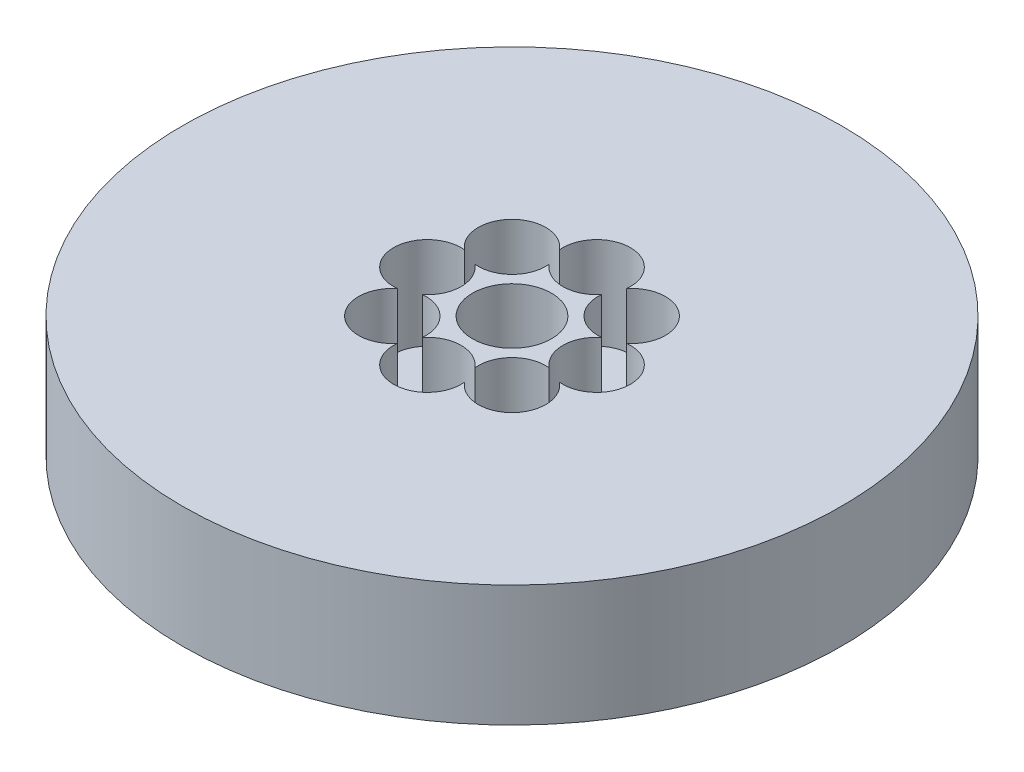
ISO-10303-21;
HEADER;
FILE_DESCRIPTION(('STEP AP214'),'2;1');
FILE_NAME('part.step','',(''),(''),'','','');
FILE_SCHEMA(('AUTOMOTIVE_DESIGN { 1 0 10303 214 1 1 1 1 }'));
ENDSEC;
DATA;
#1=APPLICATION_CONTEXT('core data for automotive mechanical design processes');
#2=APPLICATION_PROTOCOL_DEFINITION('international standard','automotive_design',2000,#1);
#3=PRODUCT_CONTEXT('',#1,'mechanical');
#4=PRODUCT('Part','Part','',(#3));
#5=PRODUCT_RELATED_PRODUCT_CATEGORY('part','',(#4));
#6=PRODUCT_DEFINITION_FORMATION('','',#4);
#7=PRODUCT_DEFINITION_CONTEXT('part definition',#1,'design');
#8=PRODUCT_DEFINITION('design','',#6,#7);
#9=PRODUCT_DEFINITION_SHAPE('','',#8);
#10=(LENGTH_UNIT() NAMED_UNIT(*) SI_UNIT(.MILLI.,.METRE.));
#11=(NAMED_UNIT(*) PLANE_ANGLE_UNIT() SI_UNIT($,.RADIAN.));
#12=(NAMED_UNIT(*) SI_UNIT($,.STERADIAN.) SOLID_ANGLE_UNIT());
#13=UNCERTAINTY_MEASURE_WITH_UNIT(LENGTH_MEASURE(1.E-05),#10,'distance_accuracy_value','');
#14=(GEOMETRIC_REPRESENTATION_CONTEXT(3) GLOBAL_UNCERTAINTY_ASSIGNED_CONTEXT((#13)) GLOBAL_UNIT_ASSIGNED_CONTEXT((#10,
#11,#12)) REPRESENTATION_CONTEXT('',''));
#15=CARTESIAN_POINT('',(0.,0.,0.));
#16=DIRECTION('',(0.,0.,1.));
#17=DIRECTION('',(1.,0.,0.));
#18=AXIS2_PLACEMENT_3D('',#15,#16,#17);
#19=CARTESIAN_POINT('',(0.,23.,0.));
#20=DIRECTION('',(0.,1.,0.));
#21=DIRECTION('',(0.,0.,1.));
#22=AXIS2_PLACEMENT_3D('',#19,#20,#21);
#23=PLANE('',#22);
#24=CARTESIAN_POINT('',(-11.3499906709509,23.,11.349990670951));
#25=DIRECTION('',(0.,1.,0.));
#26=DIRECTION('',(0.707106781186549,0.,0.707106781186546));
#27=AXIS2_PLACEMENT_3D('',#24,#25,#26);
#28=CIRCLE('',#27,6.40229908759105);
#29=CARTESIAN_POINT('',(-4.98422694005276,23.,12.0329882766208));
#30=VERTEX_POINT('',#29);
#31=CARTESIAN_POINT('',(-12.0329882766208,23.,4.9842269400528));
#32=VERTEX_POINT('',#31);
#33=EDGE_CURVE('E248',#30,#32,#28,.T.);
#34=ORIENTED_EDGE('',*,*,#33,.F.);
#35=CARTESIAN_POINT('',(0.,23.,16.0513107396669));
#36=DIRECTION('',(0.,1.,0.));
#37=DIRECTION('',(1.,0.,0.));
#38=AXIS2_PLACEMENT_3D('',#35,#36,#37);
#39=CIRCLE('',#38,6.40229908759105);
#40=CARTESIAN_POINT('',(4.98422694005284,23.,12.0329882766208));
#41=VERTEX_POINT('',#40);
#42=EDGE_CURVE('E230',#41,#30,#39,.T.);
#43=ORIENTED_EDGE('',*,*,#42,.F.);
#44=CARTESIAN_POINT('',(11.349990670951,23.,11.3499906709509));
#45=DIRECTION('',(0.,1.,0.));
#46=DIRECTION('',(0.707106781186544,0.,-0.707106781186551));
#47=AXIS2_PLACEMENT_3D('',#44,#45,#46);
#48=CIRCLE('',#47,6.40229908759105);
#49=CARTESIAN_POINT('',(12.0329882766207,23.,4.9842269400527));
#50=VERTEX_POINT('',#49);
#51=EDGE_CURVE('E204',#50,#41,#48,.T.);
#52=ORIENTED_EDGE('',*,*,#51,.F.);
#53=CARTESIAN_POINT('',(16.0513107396669,23.,0.));
#54=DIRECTION('',(0.,1.,0.));
#55=DIRECTION('',(0.,0.,-1.));
#56=AXIS2_PLACEMENT_3D('',#53,#54,#55);
#57=CIRCLE('',#56,6.40229908759105);
#58=CARTESIAN_POINT('',(12.0329882766209,23.,-4.9842269400529));
#59=VERTEX_POINT('',#58);
#60=EDGE_CURVE('E206',#59,#50,#57,.T.);
#61=ORIENTED_EDGE('',*,*,#60,.F.);
#62=CARTESIAN_POINT('',(11.3499906709508,23.,-11.349990670951));
#63=DIRECTION('',(0.,1.,0.));
#64=DIRECTION('',(-0.707106781186554,0.,-0.707106781186541));
#65=AXIS2_PLACEMENT_3D('',#62,#63,#64);
#66=CIRCLE('',#65,6.40229908759105);
#67=CARTESIAN_POINT('',(4.98422694005267,23.,-12.0329882766208));
#68=VERTEX_POINT('',#67);
#69=EDGE_CURVE('E186',#68,#59,#66,.T.);
#70=ORIENTED_EDGE('',*,*,#69,.F.);
#71=CARTESIAN_POINT('',(-1.68128555734558E-13,23.,-16.0513107396669));
#72=DIRECTION('',(0.,1.,0.));
#73=DIRECTION('',(-1.,0.,0.));
#74=AXIS2_PLACEMENT_3D('',#71,#72,#73);
#75=CIRCLE('',#74,6.40229908759105);
#76=CARTESIAN_POINT('',(-4.98422694005292,23.,-12.0329882766207));
#77=VERTEX_POINT('',#76);
#78=EDGE_CURVE('E163',#77,#68,#75,.T.);
#79=ORIENTED_EDGE('',*,*,#78,.F.);
#80=CARTESIAN_POINT('',(-11.3499906709511,23.,-11.3499906709508));
#81=DIRECTION('',(0.,1.,0.));
#82=DIRECTION('',(-0.707106781186539,0.,0.707106781186556));
#83=AXIS2_PLACEMENT_3D('',#80,#81,#82);
#84=CIRCLE('',#83,6.40229908759105);
#85=CARTESIAN_POINT('',(-12.0329882766205,23.,-4.9842269400526));
#86=VERTEX_POINT('',#85);
#87=EDGE_CURVE('E182',#86,#77,#84,.T.);
#88=ORIENTED_EDGE('',*,*,#87,.F.);
#89=CARTESIAN_POINT('',(-16.0513107396669,23.,0.));
#90=DIRECTION('',(0.,1.,0.));
#91=DIRECTION('',(0.,0.,1.));
#92=AXIS2_PLACEMENT_3D('',#89,#90,#91);
#93=CIRCLE('',#92,6.40229908759105);
#94=EDGE_CURVE('E261',#32,#86,#93,.T.);
#95=ORIENTED_EDGE('',*,*,#94,.F.);
#96=EDGE_LOOP('',(#34,#43,#52,#61,#70,#79,#88,#95));
#97=FACE_BOUND('',#96,.T.);
#98=CARTESIAN_POINT('',(0.,23.,0.));
#99=DIRECTION('',(0.,1.,0.));
#100=DIRECTION('',(0.,0.,1.));
#101=AXIS2_PLACEMENT_3D('',#98,#99,#100);
#102=CIRCLE('',#101,7.5);
#103=CARTESIAN_POINT('',(0.,23.,7.5));
#104=VERTEX_POINT('',#103);
#105=EDGE_CURVE('E262',#104,#104,#102,.T.);
#106=ORIENTED_EDGE('',*,*,#105,.F.);
#107=EDGE_LOOP('',(#106));
#108=FACE_BOUND('',#107,.T.);
#109=ADVANCED_FACE('F39',(#97,#108),#23,.T.);
#110=CARTESIAN_POINT('',(-16.0513107396669,5.48119012254842,0.));
#111=DIRECTION('',(0.,1.,0.));
#112=DIRECTION('',(0.,0.,1.));
#113=AXIS2_PLACEMENT_3D('',#110,#111,#112);
#114=CYLINDRICAL_SURFACE('',#113,6.40229908759105);
#115=CARTESIAN_POINT('',(-16.0513107396669,5.48119012254842,0.));
#116=DIRECTION('',(0.,1.,0.));
#117=DIRECTION('',(0.,0.,1.));
#118=AXIS2_PLACEMENT_3D('',#115,#116,#117);
#119=CIRCLE('',#118,6.40229908759105);
#120=CARTESIAN_POINT('',(-12.0329882766208,5.48119012254842,4.9842269400528));
#121=VERTEX_POINT('',#120);
#122=CARTESIAN_POINT('',(-12.0329882766205,5.48119012254842,-4.9842269400526));
#123=VERTEX_POINT('',#122);
#124=EDGE_CURVE('E257',#121,#123,#119,.T.);
#125=ORIENTED_EDGE('',*,*,#124,.F.);
#126=DIRECTION('',(0.,1.,0.));
#127=VECTOR('',#126,1.);
#128=CARTESIAN_POINT('',(-12.0329882766208,14.2405950612742,4.9842269400528));
#129=LINE('',#128,#127);
#130=EDGE_CURVE('E255',#121,#32,#129,.T.);
#131=ORIENTED_EDGE('',*,*,#130,.T.);
#132=ORIENTED_EDGE('',*,*,#94,.T.);
#133=DIRECTION('',(0.,1.,0.));
#134=VECTOR('',#133,1.);
#135=CARTESIAN_POINT('',(-12.0329882766205,14.2405950612742,-4.9842269400526));
#136=LINE('',#135,#134);
#137=EDGE_CURVE('E250',#86,#123,#136,.F.);
#138=ORIENTED_EDGE('',*,*,#137,.T.);
#139=EDGE_LOOP('',(#125,#131,#132,#138));
#140=FACE_BOUND('',#139,.T.);
#141=ADVANCED_FACE('F277',(#140),#114,.F.);
#142=CARTESIAN_POINT('',(0.,23.,0.));
#143=DIRECTION('',(0.,-1.,0.));
#144=DIRECTION('',(0.,0.,-1.));
#145=AXIS2_PLACEMENT_3D('',#142,#143,#144);
#146=CYLINDRICAL_SURFACE('',#145,62.5);
#147=CARTESIAN_POINT('',(0.,23.,0.));
#148=DIRECTION('',(0.,1.,0.));
#149=DIRECTION('',(0.,0.,1.));
#150=AXIS2_PLACEMENT_3D('',#147,#148,#149);
#151=CIRCLE('',#150,62.5);
#152=CARTESIAN_POINT('',(0.,23.,62.5));
#153=VERTEX_POINT('',#152);
#154=EDGE_CURVE('E11',#153,#153,#151,.T.);
#155=ORIENTED_EDGE('',*,*,#154,.F.);
#156=EDGE_LOOP('',(#155));
#157=FACE_BOUND('',#156,.T.);
#158=CARTESIAN_POINT('',(0.,0.,0.));
#159=DIRECTION('',(0.,1.,0.));
#160=DIRECTION('',(0.,0.,1.));
#161=AXIS2_PLACEMENT_3D('',#158,#159,#160);
#162=CIRCLE('',#161,62.5);
#163=CARTESIAN_POINT('',(0.,0.,62.5));
#164=VERTEX_POINT('',#163);
#165=EDGE_CURVE('E43',#164,#164,#162,.T.);
#166=ORIENTED_EDGE('',*,*,#165,.T.);
#167=EDGE_LOOP('',(#166));
#168=FACE_BOUND('',#167,.T.);
#169=ADVANCED_FACE('F41',(#157,#168),#146,.T.);
#170=CARTESIAN_POINT('',(-15.368313133997,23.,6.36576373089816));
#171=VERTEX_POINT('',#170);
#172=CARTESIAN_POINT('',(-6.3657637308981,23.,15.3683131339971));
#173=VERTEX_POINT('',#172);
#174=EDGE_CURVE('E242',#171,#173,#28,.T.);
#175=ORIENTED_EDGE('',*,*,#174,.F.);
#176=CARTESIAN_POINT('',(-15.3683131339975,23.,-6.3657637308982));
#177=VERTEX_POINT('',#176);
#178=EDGE_CURVE('E260',#177,#171,#93,.T.);
#179=ORIENTED_EDGE('',*,*,#178,.F.);
#180=CARTESIAN_POINT('',(-6.36576373089832,23.,-15.368313133997));
#181=VERTEX_POINT('',#180);
#182=EDGE_CURVE('E178',#181,#177,#84,.T.);
#183=ORIENTED_EDGE('',*,*,#182,.F.);
#184=CARTESIAN_POINT('',(6.36576373089799,23.,-15.3683131339971));
#185=VERTEX_POINT('',#184);
#186=EDGE_CURVE('E168',#185,#181,#75,.T.);
#187=ORIENTED_EDGE('',*,*,#186,.F.);
#188=CARTESIAN_POINT('',(15.3683131339968,23.,-6.36576373089813));
#189=VERTEX_POINT('',#188);
#190=EDGE_CURVE('E195',#189,#185,#66,.T.);
#191=ORIENTED_EDGE('',*,*,#190,.F.);
#192=CARTESIAN_POINT('',(15.3683131339972,23.,6.36576373089818));
#193=VERTEX_POINT('',#192);
#194=EDGE_CURVE('E199',#193,#189,#57,.T.);
#195=ORIENTED_EDGE('',*,*,#194,.F.);
#196=CARTESIAN_POINT('',(6.36576373089821,23.,15.368313133997));
#197=VERTEX_POINT('',#196);
#198=EDGE_CURVE('E213',#197,#193,#48,.T.);
#199=ORIENTED_EDGE('',*,*,#198,.F.);
#200=EDGE_CURVE('E222',#173,#197,#39,.T.);
#201=ORIENTED_EDGE('',*,*,#200,.F.);
#202=EDGE_LOOP('',(#175,#179,#183,#187,#191,#195,#199,#201));
#203=FACE_BOUND('',#202,.T.);
#204=ORIENTED_EDGE('',*,*,#154,.T.);
#205=EDGE_LOOP('',(#204));
#206=FACE_BOUND('',#205,.T.);
#207=ADVANCED_FACE('F319',(#203,#206),#23,.T.);
#208=CARTESIAN_POINT('',(0.,0.,0.));
#209=DIRECTION('',(0.,1.,0.));
#210=DIRECTION('',(0.,0.,1.));
#211=AXIS2_PLACEMENT_3D('',#208,#209,#210);
#212=PLANE('',#211);
#213=CARTESIAN_POINT('',(0.,0.,0.));
#214=DIRECTION('',(0.,1.,0.));
#215=DIRECTION('',(0.,0.,1.));
#216=AXIS2_PLACEMENT_3D('',#213,#214,#215);
#217=CIRCLE('',#216,7.5);
#218=CARTESIAN_POINT('',(0.,0.,7.5));
#219=VERTEX_POINT('',#218);
#220=EDGE_CURVE('E270',#219,#219,#217,.T.);
#221=ORIENTED_EDGE('',*,*,#220,.T.);
#222=EDGE_LOOP('',(#221));
#223=FACE_BOUND('',#222,.T.);
#224=ORIENTED_EDGE('',*,*,#165,.F.);
#225=EDGE_LOOP('',(#224));
#226=FACE_BOUND('',#225,.T.);
#227=ADVANCED_FACE('F327',(#223,#226),#212,.F.);
#228=CARTESIAN_POINT('',(0.,23.,0.));
#229=DIRECTION('',(0.,-1.,0.));
#230=DIRECTION('',(0.,0.,-1.));
#231=AXIS2_PLACEMENT_3D('',#228,#229,#230);
#232=CYLINDRICAL_SURFACE('',#231,7.5);
#233=ORIENTED_EDGE('',*,*,#105,.T.);
#234=EDGE_LOOP('',(#233));
#235=FACE_BOUND('',#234,.T.);
#236=ORIENTED_EDGE('',*,*,#220,.F.);
#237=EDGE_LOOP('',(#236));
#238=FACE_BOUND('',#237,.T.);
#239=ADVANCED_FACE('F331',(#235,#238),#232,.F.);
#240=ORIENTED_EDGE('',*,*,#178,.T.);
#241=DIRECTION('',(0.,1.,0.));
#242=VECTOR('',#241,1.);
#243=CARTESIAN_POINT('',(-15.368313133997,14.2405950612742,6.36576373089816));
#244=LINE('',#243,#242);
#245=CARTESIAN_POINT('',(-15.368313133997,5.48119012254842,6.36576373089816));
#246=VERTEX_POINT('',#245);
#247=EDGE_CURVE('E65',#171,#246,#244,.F.);
#248=ORIENTED_EDGE('',*,*,#247,.T.);
#249=CARTESIAN_POINT('',(-15.3683131339975,5.48119012254842,-6.3657637308982));
#250=VERTEX_POINT('',#249);
#251=EDGE_CURVE('E256',#250,#246,#119,.T.);
#252=ORIENTED_EDGE('',*,*,#251,.F.);
#253=DIRECTION('',(0.,1.,0.));
#254=VECTOR('',#253,1.);
#255=CARTESIAN_POINT('',(-15.3683131339975,14.2405950612742,-6.3657637308982));
#256=LINE('',#255,#254);
#257=EDGE_CURVE('E180',#250,#177,#256,.T.);
#258=ORIENTED_EDGE('',*,*,#257,.T.);
#259=EDGE_LOOP('',(#240,#248,#252,#258));
#260=FACE_BOUND('',#259,.T.);
#261=ADVANCED_FACE('F312',(#260),#114,.F.);
#262=CARTESIAN_POINT('',(-16.0513107396669,5.48119012254842,0.));
#263=DIRECTION('',(0.,1.,0.));
#264=DIRECTION('',(0.,0.,1.));
#265=AXIS2_PLACEMENT_3D('',#262,#263,#264);
#266=PLANE('',#265);
#267=CARTESIAN_POINT('',(-11.3499906709509,5.48119012254842,11.349990670951));
#268=DIRECTION('',(0.,1.,0.));
#269=DIRECTION('',(0.707106781186549,0.,0.707106781186546));
#270=AXIS2_PLACEMENT_3D('',#267,#268,#269);
#271=CIRCLE('',#270,6.40229908759105);
#272=CARTESIAN_POINT('',(-4.98422694005276,5.48119012254842,12.0329882766208));
#273=VERTEX_POINT('',#272);
#274=EDGE_CURVE('E243',#273,#121,#271,.T.);
#275=ORIENTED_EDGE('',*,*,#274,.T.);
#276=ORIENTED_EDGE('',*,*,#124,.T.);
#277=CARTESIAN_POINT('',(-11.3499906709511,5.48119012254842,-11.3499906709508));
#278=DIRECTION('',(0.,1.,0.));
#279=DIRECTION('',(-0.707106781186539,0.,0.707106781186556));
#280=AXIS2_PLACEMENT_3D('',#277,#278,#279);
#281=CIRCLE('',#280,6.40229908759105);
#282=CARTESIAN_POINT('',(-4.98422694005292,5.48119012254842,-12.0329882766207));
#283=VERTEX_POINT('',#282);
#284=EDGE_CURVE('E53',#123,#283,#281,.T.);
#285=ORIENTED_EDGE('',*,*,#284,.T.);
#286=CARTESIAN_POINT('',(-1.68128555734558E-13,5.48119012254842,-16.0513107396669));
#287=DIRECTION('',(0.,1.,0.));
#288=DIRECTION('',(-1.,0.,0.));
#289=AXIS2_PLACEMENT_3D('',#286,#287,#288);
#290=CIRCLE('',#289,6.40229908759105);
#291=CARTESIAN_POINT('',(4.98422694005267,5.48119012254842,-12.0329882766208));
#292=VERTEX_POINT('',#291);
#293=EDGE_CURVE('E162',#283,#292,#290,.T.);
#294=ORIENTED_EDGE('',*,*,#293,.T.);
#295=CARTESIAN_POINT('',(11.3499906709508,5.48119012254842,-11.349990670951));
#296=DIRECTION('',(0.,1.,0.));
#297=DIRECTION('',(-0.707106781186554,0.,-0.707106781186541));
#298=AXIS2_PLACEMENT_3D('',#295,#296,#297);
#299=CIRCLE('',#298,6.40229908759105);
#300=CARTESIAN_POINT('',(12.0329882766209,5.48119012254842,-4.9842269400529));
#301=VERTEX_POINT('',#300);
#302=EDGE_CURVE('E191',#292,#301,#299,.T.);
#303=ORIENTED_EDGE('',*,*,#302,.T.);
#304=CARTESIAN_POINT('',(16.0513107396669,5.48119012254842,0.));
#305=DIRECTION('',(0.,1.,0.));
#306=DIRECTION('',(0.,0.,-1.));
#307=AXIS2_PLACEMENT_3D('',#304,#305,#306);
#308=CIRCLE('',#307,6.40229908759105);
#309=CARTESIAN_POINT('',(12.0329882766207,5.48119012254842,4.9842269400527));
#310=VERTEX_POINT('',#309);
#311=EDGE_CURVE('E203',#301,#310,#308,.T.);
#312=ORIENTED_EDGE('',*,*,#311,.T.);
#313=CARTESIAN_POINT('',(11.349990670951,5.48119012254842,11.3499906709509));
#314=DIRECTION('',(0.,1.,0.));
#315=DIRECTION('',(0.707106781186544,0.,-0.707106781186551));
#316=AXIS2_PLACEMENT_3D('',#313,#314,#315);
#317=CIRCLE('',#316,6.40229908759105);
#318=CARTESIAN_POINT('',(4.98422694005284,5.48119012254842,12.0329882766208));
#319=VERTEX_POINT('',#318);
#320=EDGE_CURVE('E215',#310,#319,#317,.T.);
#321=ORIENTED_EDGE('',*,*,#320,.T.);
#322=CARTESIAN_POINT('',(0.,5.48119012254842,16.0513107396669));
#323=DIRECTION('',(0.,1.,0.));
#324=DIRECTION('',(1.,0.,0.));
#325=AXIS2_PLACEMENT_3D('',#322,#323,#324);
#326=CIRCLE('',#325,6.40229908759105);
#327=EDGE_CURVE('E225',#319,#273,#326,.T.);
#328=ORIENTED_EDGE('',*,*,#327,.T.);
#329=EDGE_LOOP('',(#275,#276,#285,#294,#303,#312,#321,#328));
#330=FACE_BOUND('',#329,.T.);
#331=ORIENTED_EDGE('',*,*,#251,.T.);
#332=CARTESIAN_POINT('',(-6.3657637308981,5.48119012254842,15.3683131339971));
#333=VERTEX_POINT('',#332);
#334=EDGE_CURVE('E247',#246,#333,#271,.T.);
#335=ORIENTED_EDGE('',*,*,#334,.T.);
#336=CARTESIAN_POINT('',(6.36576373089821,5.48119012254842,15.368313133997));
#337=VERTEX_POINT('',#336);
#338=EDGE_CURVE('E226',#333,#337,#326,.T.);
#339=ORIENTED_EDGE('',*,*,#338,.T.);
#340=CARTESIAN_POINT('',(15.3683131339973,5.48119012254842,6.36576373089818));
#341=VERTEX_POINT('',#340);
#342=EDGE_CURVE('E207',#337,#341,#317,.T.);
#343=ORIENTED_EDGE('',*,*,#342,.T.);
#344=CARTESIAN_POINT('',(15.3683131339968,5.48119012254842,-6.36576373089813));
#345=VERTEX_POINT('',#344);
#346=EDGE_CURVE('E202',#341,#345,#308,.T.);
#347=ORIENTED_EDGE('',*,*,#346,.T.);
#348=CARTESIAN_POINT('',(6.36576373089799,5.48119012254842,-15.3683131339971));
#349=VERTEX_POINT('',#348);
#350=EDGE_CURVE('E159',#345,#349,#299,.T.);
#351=ORIENTED_EDGE('',*,*,#350,.T.);
#352=CARTESIAN_POINT('',(-6.36576373089832,5.48119012254842,-15.368313133997));
#353=VERTEX_POINT('',#352);
#354=EDGE_CURVE('E155',#349,#353,#290,.T.);
#355=ORIENTED_EDGE('',*,*,#354,.T.);
#356=EDGE_CURVE('E160',#353,#250,#281,.T.);
#357=ORIENTED_EDGE('',*,*,#356,.T.);
#358=EDGE_LOOP('',(#331,#335,#339,#343,#347,#351,#355,#357));
#359=FACE_BOUND('',#358,.T.);
#360=ADVANCED_FACE('F154',(#330,#359),#266,.T.);
#361=CARTESIAN_POINT('',(-11.3499906709509,5.48119012254842,11.349990670951));
#362=DIRECTION('',(0.,1.,0.));
#363=DIRECTION('',(0.,0.,1.));
#364=AXIS2_PLACEMENT_3D('',#361,#362,#363);
#365=CYLINDRICAL_SURFACE('',#364,6.40229908759105);
#366=ORIENTED_EDGE('',*,*,#274,.F.);
#367=DIRECTION('',(0.,1.,0.));
#368=VECTOR('',#367,1.);
#369=CARTESIAN_POINT('',(-4.98422694005276,14.2405950612742,12.0329882766208));
#370=LINE('',#369,#368);
#371=EDGE_CURVE('E241',#273,#30,#370,.T.);
#372=ORIENTED_EDGE('',*,*,#371,.T.);
#373=ORIENTED_EDGE('',*,*,#33,.T.);
#374=ORIENTED_EDGE('',*,*,#130,.F.);
#375=EDGE_LOOP('',(#366,#372,#373,#374));
#376=FACE_BOUND('',#375,.T.);
#377=ADVANCED_FACE('F307',(#376),#365,.F.);
#378=ORIENTED_EDGE('',*,*,#174,.T.);
#379=DIRECTION('',(0.,1.,0.));
#380=VECTOR('',#379,1.);
#381=CARTESIAN_POINT('',(-6.3657637308981,14.2405950612742,15.3683131339971));
#382=LINE('',#381,#380);
#383=EDGE_CURVE('E236',#173,#333,#382,.F.);
#384=ORIENTED_EDGE('',*,*,#383,.T.);
#385=ORIENTED_EDGE('',*,*,#334,.F.);
#386=ORIENTED_EDGE('',*,*,#247,.F.);
#387=EDGE_LOOP('',(#378,#384,#385,#386));
#388=FACE_BOUND('',#387,.T.);
#389=ADVANCED_FACE('F310',(#388),#365,.F.);
#390=CARTESIAN_POINT('',(-11.3499906709511,5.48119012254842,-11.3499906709508));
#391=DIRECTION('',(0.,1.,0.));
#392=DIRECTION('',(0.,0.,1.));
#393=AXIS2_PLACEMENT_3D('',#390,#391,#392);
#394=CYLINDRICAL_SURFACE('',#393,6.40229908759105);
#395=ORIENTED_EDGE('',*,*,#356,.F.);
#396=DIRECTION('',(0.,1.,0.));
#397=VECTOR('',#396,1.);
#398=CARTESIAN_POINT('',(-6.36576373089832,14.2405950612742,-15.368313133997));
#399=LINE('',#398,#397);
#400=EDGE_CURVE('E170',#181,#353,#399,.F.);
#401=ORIENTED_EDGE('',*,*,#400,.F.);
#402=ORIENTED_EDGE('',*,*,#182,.T.);
#403=ORIENTED_EDGE('',*,*,#257,.F.);
#404=EDGE_LOOP('',(#395,#401,#402,#403));
#405=FACE_BOUND('',#404,.T.);
#406=ADVANCED_FACE('F174',(#405),#394,.F.);
#407=ORIENTED_EDGE('',*,*,#87,.T.);
#408=DIRECTION('',(0.,1.,0.));
#409=VECTOR('',#408,1.);
#410=CARTESIAN_POINT('',(-4.98422694005292,14.2405950612742,-12.0329882766207));
#411=LINE('',#410,#409);
#412=EDGE_CURVE('E172',#283,#77,#411,.T.);
#413=ORIENTED_EDGE('',*,*,#412,.F.);
#414=ORIENTED_EDGE('',*,*,#284,.F.);
#415=ORIENTED_EDGE('',*,*,#137,.F.);
#416=EDGE_LOOP('',(#407,#413,#414,#415));
#417=FACE_BOUND('',#416,.T.);
#418=ADVANCED_FACE('F278',(#417),#394,.F.);
#419=CARTESIAN_POINT('',(0.,5.48119012254842,16.0513107396669));
#420=DIRECTION('',(0.,1.,0.));
#421=DIRECTION('',(0.,0.,1.));
#422=AXIS2_PLACEMENT_3D('',#419,#420,#421);
#423=CYLINDRICAL_SURFACE('',#422,6.40229908759105);
#424=ORIENTED_EDGE('',*,*,#327,.F.);
#425=DIRECTION('',(0.,1.,0.));
#426=VECTOR('',#425,1.);
#427=CARTESIAN_POINT('',(4.98422694005284,14.2405950612742,12.0329882766208));
#428=LINE('',#427,#426);
#429=EDGE_CURVE('E217',#319,#41,#428,.T.);
#430=ORIENTED_EDGE('',*,*,#429,.T.);
#431=ORIENTED_EDGE('',*,*,#42,.T.);
#432=ORIENTED_EDGE('',*,*,#371,.F.);
#433=EDGE_LOOP('',(#424,#430,#431,#432));
#434=FACE_BOUND('',#433,.T.);
#435=ADVANCED_FACE('F303',(#434),#423,.F.);
#436=CARTESIAN_POINT('',(11.3499906709508,5.48119012254842,-11.349990670951));
#437=DIRECTION('',(0.,1.,0.));
#438=DIRECTION('',(0.,0.,1.));
#439=AXIS2_PLACEMENT_3D('',#436,#437,#438);
#440=CYLINDRICAL_SURFACE('',#439,6.40229908759105);
#441=DIRECTION('',(0.,1.,0.));
#442=VECTOR('',#441,1.);
#443=CARTESIAN_POINT('',(4.98422694005267,14.2405950612742,-12.0329882766208));
#444=LINE('',#443,#442);
#445=EDGE_CURVE('E237',#292,#68,#444,.T.);
#446=ORIENTED_EDGE('',*,*,#445,.T.);
#447=ORIENTED_EDGE('',*,*,#69,.T.);
#448=DIRECTION('',(0.,1.,0.));
#449=VECTOR('',#448,1.);
#450=CARTESIAN_POINT('',(12.0329882766209,14.2405950612742,-4.9842269400529));
#451=LINE('',#450,#449);
#452=EDGE_CURVE('E197',#301,#59,#451,.T.);
#453=ORIENTED_EDGE('',*,*,#452,.F.);
#454=ORIENTED_EDGE('',*,*,#302,.F.);
#455=EDGE_LOOP('',(#446,#447,#453,#454));
#456=FACE_BOUND('',#455,.T.);
#457=ADVANCED_FACE('F294',(#456),#440,.F.);
#458=CARTESIAN_POINT('',(11.349990670951,5.48119012254842,11.3499906709509));
#459=DIRECTION('',(0.,1.,0.));
#460=DIRECTION('',(0.,0.,1.));
#461=AXIS2_PLACEMENT_3D('',#458,#459,#460);
#462=CYLINDRICAL_SURFACE('',#461,6.40229908759105);
#463=DIRECTION('',(0.,1.,0.));
#464=VECTOR('',#463,1.);
#465=CARTESIAN_POINT('',(12.0329882766207,14.2405950612742,4.9842269400527));
#466=LINE('',#465,#464);
#467=EDGE_CURVE('E235',#310,#50,#466,.T.);
#468=ORIENTED_EDGE('',*,*,#467,.T.);
#469=ORIENTED_EDGE('',*,*,#51,.T.);
#470=ORIENTED_EDGE('',*,*,#429,.F.);
#471=ORIENTED_EDGE('',*,*,#320,.F.);
#472=EDGE_LOOP('',(#468,#469,#470,#471));
#473=FACE_BOUND('',#472,.T.);
#474=ADVANCED_FACE('F301',(#473),#462,.F.);
#475=ORIENTED_EDGE('',*,*,#200,.T.);
#476=DIRECTION('',(0.,1.,0.));
#477=VECTOR('',#476,1.);
#478=CARTESIAN_POINT('',(6.36576373089821,14.2405950612742,15.368313133997));
#479=LINE('',#478,#477);
#480=EDGE_CURVE('E211',#197,#337,#479,.F.);
#481=ORIENTED_EDGE('',*,*,#480,.T.);
#482=ORIENTED_EDGE('',*,*,#338,.F.);
#483=ORIENTED_EDGE('',*,*,#383,.F.);
#484=EDGE_LOOP('',(#475,#481,#482,#483));
#485=FACE_BOUND('',#484,.T.);
#486=ADVANCED_FACE('F348',(#485),#423,.F.);
#487=DIRECTION('',(0.,1.,0.));
#488=VECTOR('',#487,1.);
#489=CARTESIAN_POINT('',(15.3683131339973,14.2405950612742,6.36576373089818));
#490=LINE('',#489,#488);
#491=EDGE_CURVE('E223',#193,#341,#490,.F.);
#492=ORIENTED_EDGE('',*,*,#491,.T.);
#493=ORIENTED_EDGE('',*,*,#342,.F.);
#494=ORIENTED_EDGE('',*,*,#480,.F.);
#495=ORIENTED_EDGE('',*,*,#198,.T.);
#496=EDGE_LOOP('',(#492,#493,#494,#495));
#497=FACE_BOUND('',#496,.T.);
#498=ADVANCED_FACE('F353',(#497),#462,.F.);
#499=CARTESIAN_POINT('',(16.0513107396669,5.48119012254842,0.));
#500=DIRECTION('',(0.,1.,0.));
#501=DIRECTION('',(0.,0.,1.));
#502=AXIS2_PLACEMENT_3D('',#499,#500,#501);
#503=CYLINDRICAL_SURFACE('',#502,6.40229908759105);
#504=ORIENTED_EDGE('',*,*,#311,.F.);
#505=ORIENTED_EDGE('',*,*,#452,.T.);
#506=ORIENTED_EDGE('',*,*,#60,.T.);
#507=ORIENTED_EDGE('',*,*,#467,.F.);
#508=EDGE_LOOP('',(#504,#505,#506,#507));
#509=FACE_BOUND('',#508,.T.);
#510=ADVANCED_FACE('F296',(#509),#503,.F.);
#511=ORIENTED_EDGE('',*,*,#194,.T.);
#512=DIRECTION('',(0.,1.,0.));
#513=VECTOR('',#512,1.);
#514=CARTESIAN_POINT('',(15.3683131339968,14.2405950612742,-6.36576373089813));
#515=LINE('',#514,#513);
#516=EDGE_CURVE('E189',#189,#345,#515,.F.);
#517=ORIENTED_EDGE('',*,*,#516,.T.);
#518=ORIENTED_EDGE('',*,*,#346,.F.);
#519=ORIENTED_EDGE('',*,*,#491,.F.);
#520=EDGE_LOOP('',(#511,#517,#518,#519));
#521=FACE_BOUND('',#520,.T.);
#522=ADVANCED_FACE('F357',(#521),#503,.F.);
#523=DIRECTION('',(0.,1.,0.));
#524=VECTOR('',#523,1.);
#525=CARTESIAN_POINT('',(6.36576373089799,14.2405950612742,-15.3683131339971));
#526=LINE('',#525,#524);
#527=EDGE_CURVE('E233',#185,#349,#526,.F.);
#528=ORIENTED_EDGE('',*,*,#527,.T.);
#529=ORIENTED_EDGE('',*,*,#350,.F.);
#530=ORIENTED_EDGE('',*,*,#516,.F.);
#531=ORIENTED_EDGE('',*,*,#190,.T.);
#532=EDGE_LOOP('',(#528,#529,#530,#531));
#533=FACE_BOUND('',#532,.T.);
#534=ADVANCED_FACE('F362',(#533),#440,.F.);
#535=CARTESIAN_POINT('',(-1.68128555734558E-13,5.48119012254842,-16.0513107396669));
#536=DIRECTION('',(0.,1.,0.));
#537=DIRECTION('',(0.,0.,1.));
#538=AXIS2_PLACEMENT_3D('',#535,#536,#537);
#539=CYLINDRICAL_SURFACE('',#538,6.40229908759105);
#540=ORIENTED_EDGE('',*,*,#293,.F.);
#541=ORIENTED_EDGE('',*,*,#412,.T.);
#542=ORIENTED_EDGE('',*,*,#78,.T.);
#543=ORIENTED_EDGE('',*,*,#445,.F.);
#544=EDGE_LOOP('',(#540,#541,#542,#543));
#545=FACE_BOUND('',#544,.T.);
#546=ADVANCED_FACE('F288',(#545),#539,.F.);
#547=ORIENTED_EDGE('',*,*,#186,.T.);
#548=ORIENTED_EDGE('',*,*,#400,.T.);
#549=ORIENTED_EDGE('',*,*,#354,.F.);
#550=ORIENTED_EDGE('',*,*,#527,.F.);
#551=EDGE_LOOP('',(#547,#548,#549,#550));
#552=FACE_BOUND('',#551,.T.);
#553=ADVANCED_FACE('F169',(#552),#539,.F.);
#554=CLOSED_SHELL('',(#109,#141,#169,#207,#227,#239,#261,#360,#377,#389,#406,#418,#435,#457,
#474,#486,#498,#510,#522,#534,#546,#553));
#555=MANIFOLD_SOLID_BREP('B2',#554);
#556=ADVANCED_BREP_SHAPE_REPRESENTATION('',(#18,#555),#14);
#557=SHAPE_DEFINITION_REPRESENTATION(#9,#556);
ENDSEC;
END-ISO-10303-21;
